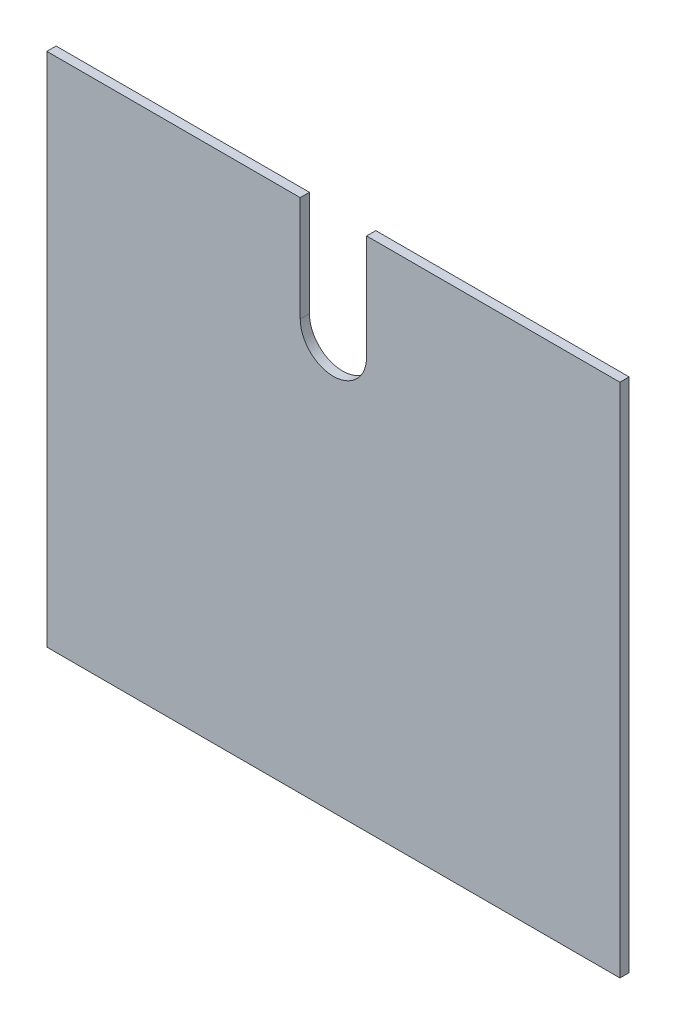
ISO-10303-21;
HEADER;
FILE_DESCRIPTION(('STEP AP214'),'2;1');
FILE_NAME('part.step','',(''),(''),'','','');
FILE_SCHEMA(('AUTOMOTIVE_DESIGN { 1 0 10303 214 1 1 1 1 }'));
ENDSEC;
DATA;
#1=APPLICATION_CONTEXT('core data for automotive mechanical design processes');
#2=APPLICATION_PROTOCOL_DEFINITION('international standard','automotive_design',2000,#1);
#3=PRODUCT_CONTEXT('',#1,'mechanical');
#4=PRODUCT('Part','Part','',(#3));
#5=PRODUCT_RELATED_PRODUCT_CATEGORY('part','',(#4));
#6=PRODUCT_DEFINITION_FORMATION('','',#4);
#7=PRODUCT_DEFINITION_CONTEXT('part definition',#1,'design');
#8=PRODUCT_DEFINITION('design','',#6,#7);
#9=PRODUCT_DEFINITION_SHAPE('','',#8);
#10=(LENGTH_UNIT() NAMED_UNIT(*) SI_UNIT(.MILLI.,.METRE.));
#11=(NAMED_UNIT(*) PLANE_ANGLE_UNIT() SI_UNIT($,.RADIAN.));
#12=(NAMED_UNIT(*) SI_UNIT($,.STERADIAN.) SOLID_ANGLE_UNIT());
#13=UNCERTAINTY_MEASURE_WITH_UNIT(LENGTH_MEASURE(1.E-05),#10,'distance_accuracy_value','');
#14=(GEOMETRIC_REPRESENTATION_CONTEXT(3) GLOBAL_UNCERTAINTY_ASSIGNED_CONTEXT((#13)) GLOBAL_UNIT_ASSIGNED_CONTEXT((#10,
#11,#12)) REPRESENTATION_CONTEXT('',''));
#15=CARTESIAN_POINT('',(0.,0.,0.));
#16=DIRECTION('',(0.,0.,1.));
#17=DIRECTION('',(1.,0.,0.));
#18=AXIS2_PLACEMENT_3D('',#15,#16,#17);
#19=CARTESIAN_POINT('',(0.,0.,6.35));
#20=DIRECTION('',(1.,0.,0.));
#21=DIRECTION('',(0.,0.,-1.));
#22=AXIS2_PLACEMENT_3D('',#19,#20,#21);
#23=PLANE('',#22);
#24=DIRECTION('',(0.,-1.,0.));
#25=VECTOR('',#24,1.);
#26=CARTESIAN_POINT('',(0.,0.,0.));
#27=LINE('',#26,#25);
#28=CARTESIAN_POINT('',(0.,355.6,0.));
#29=VERTEX_POINT('',#28);
#30=CARTESIAN_POINT('',(0.,0.,0.));
#31=VERTEX_POINT('',#30);
#32=EDGE_CURVE('E129',#29,#31,#27,.T.);
#33=ORIENTED_EDGE('',*,*,#32,.T.);
#34=DIRECTION('',(0.,0.,-1.));
#35=VECTOR('',#34,1.);
#36=CARTESIAN_POINT('',(0.,0.,6.35));
#37=LINE('',#36,#35);
#38=CARTESIAN_POINT('',(0.,0.,6.35));
#39=VERTEX_POINT('',#38);
#40=EDGE_CURVE('E11',#39,#31,#37,.T.);
#41=ORIENTED_EDGE('',*,*,#40,.F.);
#42=DIRECTION('',(0.,-1.,0.));
#43=VECTOR('',#42,1.);
#44=CARTESIAN_POINT('',(0.,0.,6.35));
#45=LINE('',#44,#43);
#46=CARTESIAN_POINT('',(0.,355.6,6.35));
#47=VERTEX_POINT('',#46);
#48=EDGE_CURVE('E143',#47,#39,#45,.T.);
#49=ORIENTED_EDGE('',*,*,#48,.F.);
#50=DIRECTION('',(0.,0.,-1.));
#51=VECTOR('',#50,1.);
#52=CARTESIAN_POINT('',(0.,355.6,6.35));
#53=LINE('',#52,#51);
#54=EDGE_CURVE('E125',#47,#29,#53,.T.);
#55=ORIENTED_EDGE('',*,*,#54,.T.);
#56=EDGE_LOOP('',(#33,#41,#49,#55));
#57=FACE_BOUND('',#56,.T.);
#58=ADVANCED_FACE('F33',(#57),#23,.F.);
#59=CARTESIAN_POINT('',(0.,0.,6.35));
#60=DIRECTION('',(0.,1.,0.));
#61=DIRECTION('',(0.,0.,1.));
#62=AXIS2_PLACEMENT_3D('',#59,#60,#61);
#63=PLANE('',#62);
#64=DIRECTION('',(1.,0.,0.));
#65=VECTOR('',#64,1.);
#66=CARTESIAN_POINT('',(0.,0.,0.));
#67=LINE('',#66,#65);
#68=CARTESIAN_POINT('',(394.97,0.,0.));
#69=VERTEX_POINT('',#68);
#70=EDGE_CURVE('E132',#31,#69,#67,.T.);
#71=ORIENTED_EDGE('',*,*,#70,.T.);
#72=DIRECTION('',(0.,0.,-1.));
#73=VECTOR('',#72,1.);
#74=CARTESIAN_POINT('',(394.97,0.,6.35));
#75=LINE('',#74,#73);
#76=CARTESIAN_POINT('',(394.97,0.,6.35));
#77=VERTEX_POINT('',#76);
#78=EDGE_CURVE('E41',#77,#69,#75,.T.);
#79=ORIENTED_EDGE('',*,*,#78,.F.);
#80=DIRECTION('',(1.,0.,0.));
#81=VECTOR('',#80,1.);
#82=CARTESIAN_POINT('',(0.,0.,6.35));
#83=LINE('',#82,#81);
#84=EDGE_CURVE('E92',#39,#77,#83,.T.);
#85=ORIENTED_EDGE('',*,*,#84,.F.);
#86=ORIENTED_EDGE('',*,*,#40,.T.);
#87=EDGE_LOOP('',(#71,#79,#85,#86));
#88=FACE_BOUND('',#87,.T.);
#89=ADVANCED_FACE('F178',(#88),#63,.F.);
#90=CARTESIAN_POINT('',(394.97,0.,6.35));
#91=DIRECTION('',(-1.,0.,0.));
#92=DIRECTION('',(0.,0.,1.));
#93=AXIS2_PLACEMENT_3D('',#90,#91,#92);
#94=PLANE('',#93);
#95=DIRECTION('',(0.,1.,0.));
#96=VECTOR('',#95,1.);
#97=CARTESIAN_POINT('',(394.97,0.,0.));
#98=LINE('',#97,#96);
#99=CARTESIAN_POINT('',(394.97,355.6,0.));
#100=VERTEX_POINT('',#99);
#101=EDGE_CURVE('E134',#69,#100,#98,.T.);
#102=ORIENTED_EDGE('',*,*,#101,.T.);
#103=DIRECTION('',(0.,0.,-1.));
#104=VECTOR('',#103,1.);
#105=CARTESIAN_POINT('',(394.97,355.6,6.35));
#106=LINE('',#105,#104);
#107=CARTESIAN_POINT('',(394.97,355.6,6.35));
#108=VERTEX_POINT('',#107);
#109=EDGE_CURVE('E150',#108,#100,#106,.T.);
#110=ORIENTED_EDGE('',*,*,#109,.F.);
#111=DIRECTION('',(0.,1.,0.));
#112=VECTOR('',#111,1.);
#113=CARTESIAN_POINT('',(394.97,0.,6.35));
#114=LINE('',#113,#112);
#115=EDGE_CURVE('E158',#77,#108,#114,.T.);
#116=ORIENTED_EDGE('',*,*,#115,.F.);
#117=ORIENTED_EDGE('',*,*,#78,.T.);
#118=EDGE_LOOP('',(#102,#110,#116,#117));
#119=FACE_BOUND('',#118,.T.);
#120=ADVANCED_FACE('F156',(#119),#94,.F.);
#121=CARTESIAN_POINT('',(220.345,355.6,6.35));
#122=DIRECTION('',(0.,-1.,0.));
#123=DIRECTION('',(0.,0.,-1.));
#124=AXIS2_PLACEMENT_3D('',#121,#122,#123);
#125=PLANE('',#124);
#126=DIRECTION('',(-1.,0.,0.));
#127=VECTOR('',#126,1.);
#128=CARTESIAN_POINT('',(220.345,355.6,0.));
#129=LINE('',#128,#127);
#130=CARTESIAN_POINT('',(220.345,355.6,0.));
#131=VERTEX_POINT('',#130);
#132=EDGE_CURVE('E136',#100,#131,#129,.T.);
#133=ORIENTED_EDGE('',*,*,#132,.T.);
#134=DIRECTION('',(0.,0.,-1.));
#135=VECTOR('',#134,1.);
#136=CARTESIAN_POINT('',(220.345,355.6,6.35));
#137=LINE('',#136,#135);
#138=CARTESIAN_POINT('',(220.345,355.6,6.35));
#139=VERTEX_POINT('',#138);
#140=EDGE_CURVE('E147',#139,#131,#137,.T.);
#141=ORIENTED_EDGE('',*,*,#140,.F.);
#142=DIRECTION('',(-1.,0.,0.));
#143=VECTOR('',#142,1.);
#144=CARTESIAN_POINT('',(220.345,355.6,6.35));
#145=LINE('',#144,#143);
#146=EDGE_CURVE('E170',#108,#139,#145,.T.);
#147=ORIENTED_EDGE('',*,*,#146,.F.);
#148=ORIENTED_EDGE('',*,*,#109,.T.);
#149=EDGE_LOOP('',(#133,#141,#147,#148));
#150=FACE_BOUND('',#149,.T.);
#151=ADVANCED_FACE('F166',(#150),#125,.F.);
#152=CARTESIAN_POINT('',(220.345,283.21,6.35));
#153=DIRECTION('',(1.,0.,0.));
#154=DIRECTION('',(0.,0.,-1.));
#155=AXIS2_PLACEMENT_3D('',#152,#153,#154);
#156=PLANE('',#155);
#157=DIRECTION('',(0.,-1.,0.));
#158=VECTOR('',#157,1.);
#159=CARTESIAN_POINT('',(220.345,283.21,0.));
#160=LINE('',#159,#158);
#161=CARTESIAN_POINT('',(220.345,283.21,0.));
#162=VERTEX_POINT('',#161);
#163=EDGE_CURVE('E138',#131,#162,#160,.T.);
#164=ORIENTED_EDGE('',*,*,#163,.T.);
#165=DIRECTION('',(0.,0.,-1.));
#166=VECTOR('',#165,1.);
#167=CARTESIAN_POINT('',(220.345,283.21,6.35));
#168=LINE('',#167,#166);
#169=CARTESIAN_POINT('',(220.345,283.21,6.35));
#170=VERTEX_POINT('',#169);
#171=EDGE_CURVE('E120',#170,#162,#168,.T.);
#172=ORIENTED_EDGE('',*,*,#171,.F.);
#173=DIRECTION('',(0.,-1.,0.));
#174=VECTOR('',#173,1.);
#175=CARTESIAN_POINT('',(220.345,283.21,6.35));
#176=LINE('',#175,#174);
#177=EDGE_CURVE('E111',#139,#170,#176,.T.);
#178=ORIENTED_EDGE('',*,*,#177,.F.);
#179=ORIENTED_EDGE('',*,*,#140,.T.);
#180=EDGE_LOOP('',(#164,#172,#178,#179));
#181=FACE_BOUND('',#180,.T.);
#182=ADVANCED_FACE('F169',(#181),#156,.F.);
#183=CARTESIAN_POINT('',(197.485,283.21,6.35));
#184=DIRECTION('',(0.,0.,-1.));
#185=DIRECTION('',(-1.,0.,0.));
#186=AXIS2_PLACEMENT_3D('',#183,#184,#185);
#187=CYLINDRICAL_SURFACE('',#186,22.86);
#188=CARTESIAN_POINT('',(197.485,283.21,0.));
#189=DIRECTION('',(0.,0.,-1.));
#190=DIRECTION('',(1.,0.,0.));
#191=AXIS2_PLACEMENT_3D('',#188,#189,#190);
#192=CIRCLE('',#191,22.86);
#193=CARTESIAN_POINT('',(174.625,283.21,0.));
#194=VERTEX_POINT('',#193);
#195=EDGE_CURVE('E119',#162,#194,#192,.T.);
#196=ORIENTED_EDGE('',*,*,#195,.T.);
#197=DIRECTION('',(0.,0.,-1.));
#198=VECTOR('',#197,1.);
#199=CARTESIAN_POINT('',(174.625,283.21,6.35));
#200=LINE('',#199,#198);
#201=CARTESIAN_POINT('',(174.625,283.21,6.35));
#202=VERTEX_POINT('',#201);
#203=EDGE_CURVE('E116',#202,#194,#200,.T.);
#204=ORIENTED_EDGE('',*,*,#203,.F.);
#205=CARTESIAN_POINT('',(197.485,283.21,6.35));
#206=DIRECTION('',(0.,0.,-1.));
#207=DIRECTION('',(1.,0.,0.));
#208=AXIS2_PLACEMENT_3D('',#205,#206,#207);
#209=CIRCLE('',#208,22.86);
#210=EDGE_CURVE('E105',#170,#202,#209,.T.);
#211=ORIENTED_EDGE('',*,*,#210,.F.);
#212=ORIENTED_EDGE('',*,*,#171,.T.);
#213=EDGE_LOOP('',(#196,#204,#211,#212));
#214=FACE_BOUND('',#213,.T.);
#215=ADVANCED_FACE('F117',(#214),#187,.F.);
#216=CARTESIAN_POINT('',(174.625,355.6,6.35));
#217=DIRECTION('',(-1.,0.,0.));
#218=DIRECTION('',(0.,0.,1.));
#219=AXIS2_PLACEMENT_3D('',#216,#217,#218);
#220=PLANE('',#219);
#221=DIRECTION('',(0.,1.,0.));
#222=VECTOR('',#221,1.);
#223=CARTESIAN_POINT('',(174.625,355.6,0.));
#224=LINE('',#223,#222);
#225=CARTESIAN_POINT('',(174.625,355.6,0.));
#226=VERTEX_POINT('',#225);
#227=EDGE_CURVE('E78',#194,#226,#224,.T.);
#228=ORIENTED_EDGE('',*,*,#227,.T.);
#229=DIRECTION('',(0.,0.,-1.));
#230=VECTOR('',#229,1.);
#231=CARTESIAN_POINT('',(174.625,355.6,6.35));
#232=LINE('',#231,#230);
#233=CARTESIAN_POINT('',(174.625,355.6,6.35));
#234=VERTEX_POINT('',#233);
#235=EDGE_CURVE('E121',#234,#226,#232,.T.);
#236=ORIENTED_EDGE('',*,*,#235,.F.);
#237=DIRECTION('',(0.,1.,0.));
#238=VECTOR('',#237,1.);
#239=CARTESIAN_POINT('',(174.625,355.6,6.35));
#240=LINE('',#239,#238);
#241=EDGE_CURVE('E109',#202,#234,#240,.T.);
#242=ORIENTED_EDGE('',*,*,#241,.F.);
#243=ORIENTED_EDGE('',*,*,#203,.T.);
#244=EDGE_LOOP('',(#228,#236,#242,#243));
#245=FACE_BOUND('',#244,.T.);
#246=ADVANCED_FACE('F123',(#245),#220,.F.);
#247=CARTESIAN_POINT('',(0.,355.6,6.35));
#248=DIRECTION('',(0.,-1.,0.));
#249=DIRECTION('',(0.,0.,-1.));
#250=AXIS2_PLACEMENT_3D('',#247,#248,#249);
#251=PLANE('',#250);
#252=DIRECTION('',(-1.,0.,0.));
#253=VECTOR('',#252,1.);
#254=CARTESIAN_POINT('',(0.,355.6,0.));
#255=LINE('',#254,#253);
#256=EDGE_CURVE('E84',#226,#29,#255,.T.);
#257=ORIENTED_EDGE('',*,*,#256,.T.);
#258=ORIENTED_EDGE('',*,*,#54,.F.);
#259=DIRECTION('',(-1.,0.,0.));
#260=VECTOR('',#259,1.);
#261=CARTESIAN_POINT('',(0.,355.6,6.35));
#262=LINE('',#261,#260);
#263=EDGE_CURVE('E49',#234,#47,#262,.T.);
#264=ORIENTED_EDGE('',*,*,#263,.F.);
#265=ORIENTED_EDGE('',*,*,#235,.T.);
#266=EDGE_LOOP('',(#257,#258,#264,#265));
#267=FACE_BOUND('',#266,.T.);
#268=ADVANCED_FACE('F194',(#267),#251,.F.);
#269=CARTESIAN_POINT('',(197.485,283.21,6.35));
#270=DIRECTION('',(0.,0.,1.));
#271=DIRECTION('',(1.,0.,0.));
#272=AXIS2_PLACEMENT_3D('',#269,#270,#271);
#273=PLANE('',#272);
#274=ORIENTED_EDGE('',*,*,#48,.T.);
#275=ORIENTED_EDGE('',*,*,#84,.T.);
#276=ORIENTED_EDGE('',*,*,#115,.T.);
#277=ORIENTED_EDGE('',*,*,#146,.T.);
#278=ORIENTED_EDGE('',*,*,#177,.T.);
#279=ORIENTED_EDGE('',*,*,#210,.T.);
#280=ORIENTED_EDGE('',*,*,#241,.T.);
#281=ORIENTED_EDGE('',*,*,#263,.T.);
#282=EDGE_LOOP('',(#274,#275,#276,#277,#278,#279,#280,#281));
#283=FACE_BOUND('',#282,.T.);
#284=ADVANCED_FACE('F107',(#283),#273,.T.);
#285=CARTESIAN_POINT('',(197.485,283.21,0.));
#286=DIRECTION('',(0.,0.,1.));
#287=DIRECTION('',(1.,0.,0.));
#288=AXIS2_PLACEMENT_3D('',#285,#286,#287);
#289=PLANE('',#288);
#290=ORIENTED_EDGE('',*,*,#32,.F.);
#291=ORIENTED_EDGE('',*,*,#256,.F.);
#292=ORIENTED_EDGE('',*,*,#227,.F.);
#293=ORIENTED_EDGE('',*,*,#195,.F.);
#294=ORIENTED_EDGE('',*,*,#163,.F.);
#295=ORIENTED_EDGE('',*,*,#132,.F.);
#296=ORIENTED_EDGE('',*,*,#101,.F.);
#297=ORIENTED_EDGE('',*,*,#70,.F.);
#298=EDGE_LOOP('',(#290,#291,#292,#293,#294,#295,#296,#297));
#299=FACE_BOUND('',#298,.T.);
#300=ADVANCED_FACE('F162',(#299),#289,.F.);
#301=CLOSED_SHELL('',(#58,#89,#120,#151,#182,#215,#246,#268,#284,#300));
#302=MANIFOLD_SOLID_BREP('B2',#301);
#303=ADVANCED_BREP_SHAPE_REPRESENTATION('',(#18,#302),#14);
#304=SHAPE_DEFINITION_REPRESENTATION(#9,#303);
ENDSEC;
END-ISO-10303-21;
